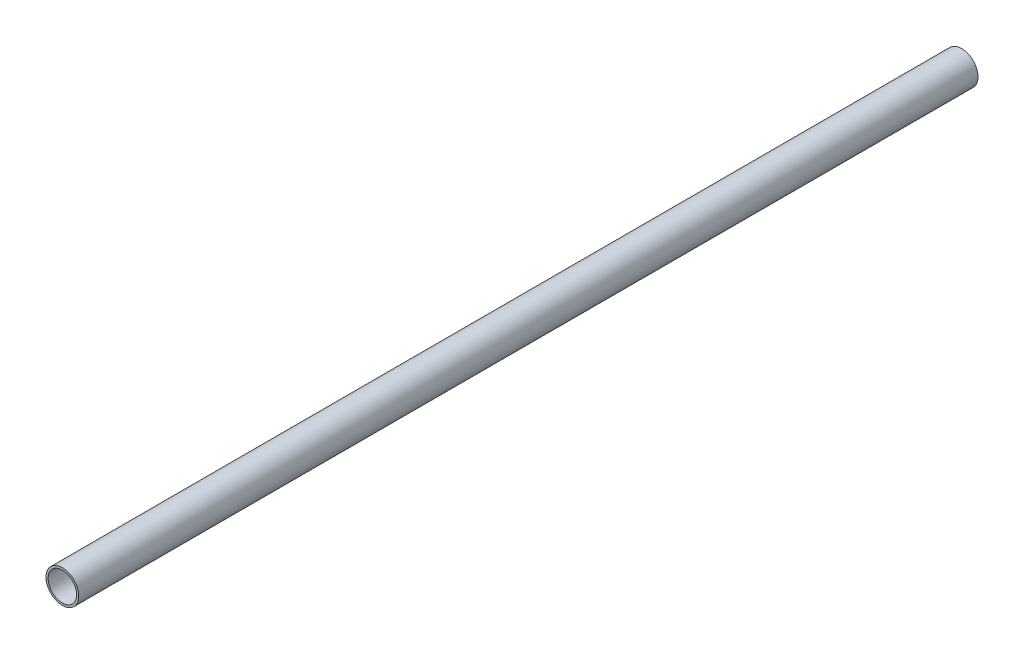
ISO-10303-21;
HEADER;
FILE_DESCRIPTION(('STEP AP214'),'2;1');
FILE_NAME('part.step','',(''),(''),'','','');
FILE_SCHEMA(('AUTOMOTIVE_DESIGN { 1 0 10303 214 1 1 1 1 }'));
ENDSEC;
DATA;
#1=APPLICATION_CONTEXT('core data for automotive mechanical design processes');
#2=APPLICATION_PROTOCOL_DEFINITION('international standard','automotive_design',2000,#1);
#3=PRODUCT_CONTEXT('',#1,'mechanical');
#4=PRODUCT('Part','Part','',(#3));
#5=PRODUCT_RELATED_PRODUCT_CATEGORY('part','',(#4));
#6=PRODUCT_DEFINITION_FORMATION('','',#4);
#7=PRODUCT_DEFINITION_CONTEXT('part definition',#1,'design');
#8=PRODUCT_DEFINITION('design','',#6,#7);
#9=PRODUCT_DEFINITION_SHAPE('','',#8);
#10=(LENGTH_UNIT() NAMED_UNIT(*) SI_UNIT(.MILLI.,.METRE.));
#11=(NAMED_UNIT(*) PLANE_ANGLE_UNIT() SI_UNIT($,.RADIAN.));
#12=(NAMED_UNIT(*) SI_UNIT($,.STERADIAN.) SOLID_ANGLE_UNIT());
#13=UNCERTAINTY_MEASURE_WITH_UNIT(LENGTH_MEASURE(1.E-05),#10,'distance_accuracy_value','');
#14=(GEOMETRIC_REPRESENTATION_CONTEXT(3) GLOBAL_UNCERTAINTY_ASSIGNED_CONTEXT((#13)) GLOBAL_UNIT_ASSIGNED_CONTEXT((#10,
#11,#12)) REPRESENTATION_CONTEXT('',''));
#15=CARTESIAN_POINT('',(0.,0.,0.));
#16=DIRECTION('',(0.,0.,1.));
#17=DIRECTION('',(1.,0.,0.));
#18=AXIS2_PLACEMENT_3D('',#15,#16,#17);
#19=CARTESIAN_POINT('',(0.,0.,1219.2));
#20=DIRECTION('',(0.,0.,1.));
#21=DIRECTION('',(1.,0.,0.));
#22=AXIS2_PLACEMENT_3D('',#19,#20,#21);
#23=PLANE('',#22);
#24=CARTESIAN_POINT('',(0.,0.,1219.2));
#25=DIRECTION('',(0.,0.,1.));
#26=DIRECTION('',(1.,0.,0.));
#27=AXIS2_PLACEMENT_3D('',#24,#25,#26);
#28=CIRCLE('',#27,44.45);
#29=CARTESIAN_POINT('',(44.45,0.,1219.2));
#30=VERTEX_POINT('',#29);
#31=EDGE_CURVE('E10',#30,#30,#28,.T.);
#32=ORIENTED_EDGE('',*,*,#31,.T.);
#33=EDGE_LOOP('',(#32));
#34=FACE_BOUND('',#33,.T.);
#35=CARTESIAN_POINT('',(0.,0.,1219.2));
#36=DIRECTION('',(0.,0.,1.));
#37=DIRECTION('',(1.,0.,0.));
#38=AXIS2_PLACEMENT_3D('',#35,#36,#37);
#39=CIRCLE('',#38,38.6334);
#40=CARTESIAN_POINT('',(38.6334,0.,1219.2));
#41=VERTEX_POINT('',#40);
#42=EDGE_CURVE('E41',#41,#41,#39,.T.);
#43=ORIENTED_EDGE('',*,*,#42,.F.);
#44=EDGE_LOOP('',(#43));
#45=FACE_BOUND('',#44,.T.);
#46=ADVANCED_FACE('F30',(#34,#45),#23,.T.);
#47=CARTESIAN_POINT('',(0.,0.,-1219.2));
#48=DIRECTION('',(0.,0.,1.));
#49=DIRECTION('',(1.,0.,0.));
#50=AXIS2_PLACEMENT_3D('',#47,#48,#49);
#51=PLANE('',#50);
#52=CARTESIAN_POINT('',(0.,0.,-1219.2));
#53=DIRECTION('',(0.,0.,1.));
#54=DIRECTION('',(1.,0.,0.));
#55=AXIS2_PLACEMENT_3D('',#52,#53,#54);
#56=CIRCLE('',#55,44.45);
#57=CARTESIAN_POINT('',(44.45,0.,-1219.2));
#58=VERTEX_POINT('',#57);
#59=EDGE_CURVE('E34',#58,#58,#56,.T.);
#60=ORIENTED_EDGE('',*,*,#59,.F.);
#61=EDGE_LOOP('',(#60));
#62=FACE_BOUND('',#61,.T.);
#63=CARTESIAN_POINT('',(0.,0.,-1219.2));
#64=DIRECTION('',(0.,0.,1.));
#65=DIRECTION('',(1.,0.,0.));
#66=AXIS2_PLACEMENT_3D('',#63,#64,#65);
#67=CIRCLE('',#66,38.6334);
#68=CARTESIAN_POINT('',(38.6334,0.,-1219.2));
#69=VERTEX_POINT('',#68);
#70=EDGE_CURVE('E43',#69,#69,#67,.T.);
#71=ORIENTED_EDGE('',*,*,#70,.T.);
#72=EDGE_LOOP('',(#71));
#73=FACE_BOUND('',#72,.T.);
#74=ADVANCED_FACE('F53',(#62,#73),#51,.F.);
#75=CARTESIAN_POINT('',(0.,0.,1219.2));
#76=DIRECTION('',(0.,0.,-1.));
#77=DIRECTION('',(-1.,0.,0.));
#78=AXIS2_PLACEMENT_3D('',#75,#76,#77);
#79=CYLINDRICAL_SURFACE('',#78,44.45);
#80=ORIENTED_EDGE('',*,*,#31,.F.);
#81=EDGE_LOOP('',(#80));
#82=FACE_BOUND('',#81,.T.);
#83=ORIENTED_EDGE('',*,*,#59,.T.);
#84=EDGE_LOOP('',(#83));
#85=FACE_BOUND('',#84,.T.);
#86=ADVANCED_FACE('F32',(#82,#85),#79,.T.);
#87=CARTESIAN_POINT('',(0.,0.,1219.2));
#88=DIRECTION('',(0.,0.,-1.));
#89=DIRECTION('',(-1.,0.,0.));
#90=AXIS2_PLACEMENT_3D('',#87,#88,#89);
#91=CYLINDRICAL_SURFACE('',#90,38.6334);
#92=ORIENTED_EDGE('',*,*,#42,.T.);
#93=EDGE_LOOP('',(#92));
#94=FACE_BOUND('',#93,.T.);
#95=ORIENTED_EDGE('',*,*,#70,.F.);
#96=EDGE_LOOP('',(#95));
#97=FACE_BOUND('',#96,.T.);
#98=ADVANCED_FACE('F49',(#94,#97),#91,.F.);
#99=CLOSED_SHELL('',(#46,#74,#86,#98));
#100=MANIFOLD_SOLID_BREP('B2',#99);
#101=ADVANCED_BREP_SHAPE_REPRESENTATION('',(#18,#100),#14);
#102=SHAPE_DEFINITION_REPRESENTATION(#9,#101);
ENDSEC;
END-ISO-10303-21;
